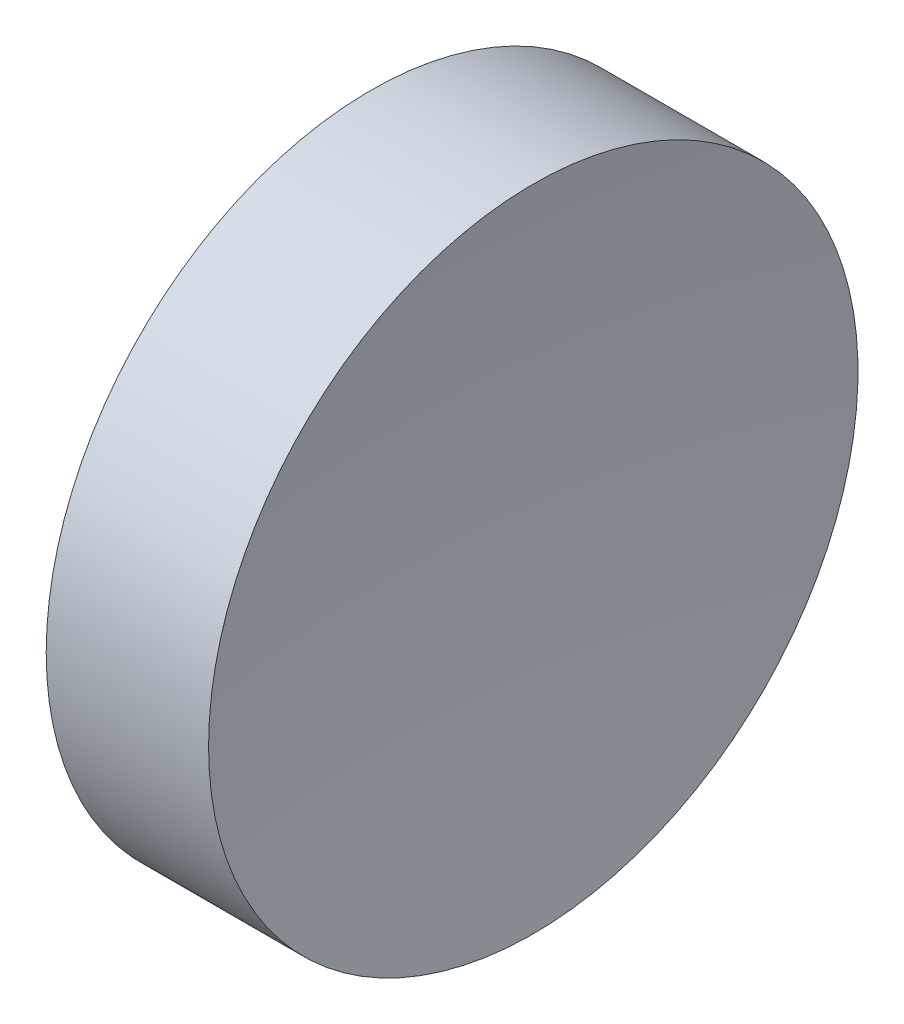
ISO-10303-21;
HEADER;
FILE_DESCRIPTION(('STEP AP214'),'2;1');
FILE_NAME('part.step','',(''),(''),'','','');
FILE_SCHEMA(('AUTOMOTIVE_DESIGN { 1 0 10303 214 1 1 1 1 }'));
ENDSEC;
DATA;
#1=APPLICATION_CONTEXT('core data for automotive mechanical design processes');
#2=APPLICATION_PROTOCOL_DEFINITION('international standard','automotive_design',2000,#1);
#3=PRODUCT_CONTEXT('',#1,'mechanical');
#4=PRODUCT('Part','Part','',(#3));
#5=PRODUCT_RELATED_PRODUCT_CATEGORY('part','',(#4));
#6=PRODUCT_DEFINITION_FORMATION('','',#4);
#7=PRODUCT_DEFINITION_CONTEXT('part definition',#1,'design');
#8=PRODUCT_DEFINITION('design','',#6,#7);
#9=PRODUCT_DEFINITION_SHAPE('','',#8);
#10=(LENGTH_UNIT() NAMED_UNIT(*) SI_UNIT(.MILLI.,.METRE.));
#11=(NAMED_UNIT(*) PLANE_ANGLE_UNIT() SI_UNIT($,.RADIAN.));
#12=(NAMED_UNIT(*) SI_UNIT($,.STERADIAN.) SOLID_ANGLE_UNIT());
#13=UNCERTAINTY_MEASURE_WITH_UNIT(LENGTH_MEASURE(1.E-05),#10,'distance_accuracy_value','');
#14=(GEOMETRIC_REPRESENTATION_CONTEXT(3) GLOBAL_UNCERTAINTY_ASSIGNED_CONTEXT((#13)) GLOBAL_UNIT_ASSIGNED_CONTEXT((#10,
#11,#12)) REPRESENTATION_CONTEXT('',''));
#15=CARTESIAN_POINT('',(0.,0.,0.));
#16=DIRECTION('',(0.,0.,1.));
#17=DIRECTION('',(1.,0.,0.));
#18=AXIS2_PLACEMENT_3D('',#15,#16,#17);
#19=CARTESIAN_POINT('',(0.,0.,0.));
#20=DIRECTION('',(1.,0.,0.));
#21=DIRECTION('',(0.,0.,-1.));
#22=AXIS2_PLACEMENT_3D('',#19,#20,#21);
#23=PLANE('',#22);
#24=CARTESIAN_POINT('',(0.,0.,0.));
#25=DIRECTION('',(-1.,0.,0.));
#26=DIRECTION('',(0.,0.,1.));
#27=AXIS2_PLACEMENT_3D('',#24,#25,#26);
#28=CIRCLE('',#27,12.7);
#29=CARTESIAN_POINT('',(0.,0.,12.7));
#30=VERTEX_POINT('',#29);
#31=EDGE_CURVE('E39',#30,#30,#28,.T.);
#32=ORIENTED_EDGE('',*,*,#31,.T.);
#33=EDGE_LOOP('',(#32));
#34=FACE_BOUND('',#33,.T.);
#35=ADVANCED_FACE('F33',(#34),#23,.F.);
#36=CARTESIAN_POINT('',(105.54,0.,0.));
#37=DIRECTION('',(-1.,0.,0.));
#38=DIRECTION('',(0.,0.,1.));
#39=AXIS2_PLACEMENT_3D('',#36,#37,#38);
#40=SPHERICAL_SURFACE('',#39,100.);
#41=CARTESIAN_POINT('',(6.34972829959583,0.,0.));
#42=DIRECTION('',(-1.,0.,0.));
#43=DIRECTION('',(0.,0.,1.));
#44=AXIS2_PLACEMENT_3D('',#41,#42,#43);
#45=CIRCLE('',#44,12.7);
#46=CARTESIAN_POINT('',(6.34972829959583,0.,12.7));
#47=VERTEX_POINT('',#46);
#48=EDGE_CURVE('E10',#47,#47,#45,.T.);
#49=ORIENTED_EDGE('',*,*,#48,.F.);
#50=EDGE_LOOP('',(#49));
#51=FACE_BOUND('',#50,.T.);
#52=ADVANCED_FACE('F48',(#51),#40,.F.);
#53=CARTESIAN_POINT('',(0.,0.,0.));
#54=DIRECTION('',(-1.,0.,0.));
#55=DIRECTION('',(0.,0.,1.));
#56=AXIS2_PLACEMENT_3D('',#53,#54,#55);
#57=CYLINDRICAL_SURFACE('',#56,12.7);
#58=ORIENTED_EDGE('',*,*,#31,.F.);
#59=EDGE_LOOP('',(#58));
#60=FACE_BOUND('',#59,.T.);
#61=ORIENTED_EDGE('',*,*,#48,.T.);
#62=EDGE_LOOP('',(#61));
#63=FACE_BOUND('',#62,.T.);
#64=ADVANCED_FACE('F46',(#60,#63),#57,.T.);
#65=CLOSED_SHELL('',(#35,#52,#64));
#66=MANIFOLD_SOLID_BREP('B2',#65);
#67=ADVANCED_BREP_SHAPE_REPRESENTATION('',(#18,#66),#14);
#68=SHAPE_DEFINITION_REPRESENTATION(#9,#67);
ENDSEC;
END-ISO-10303-21;
